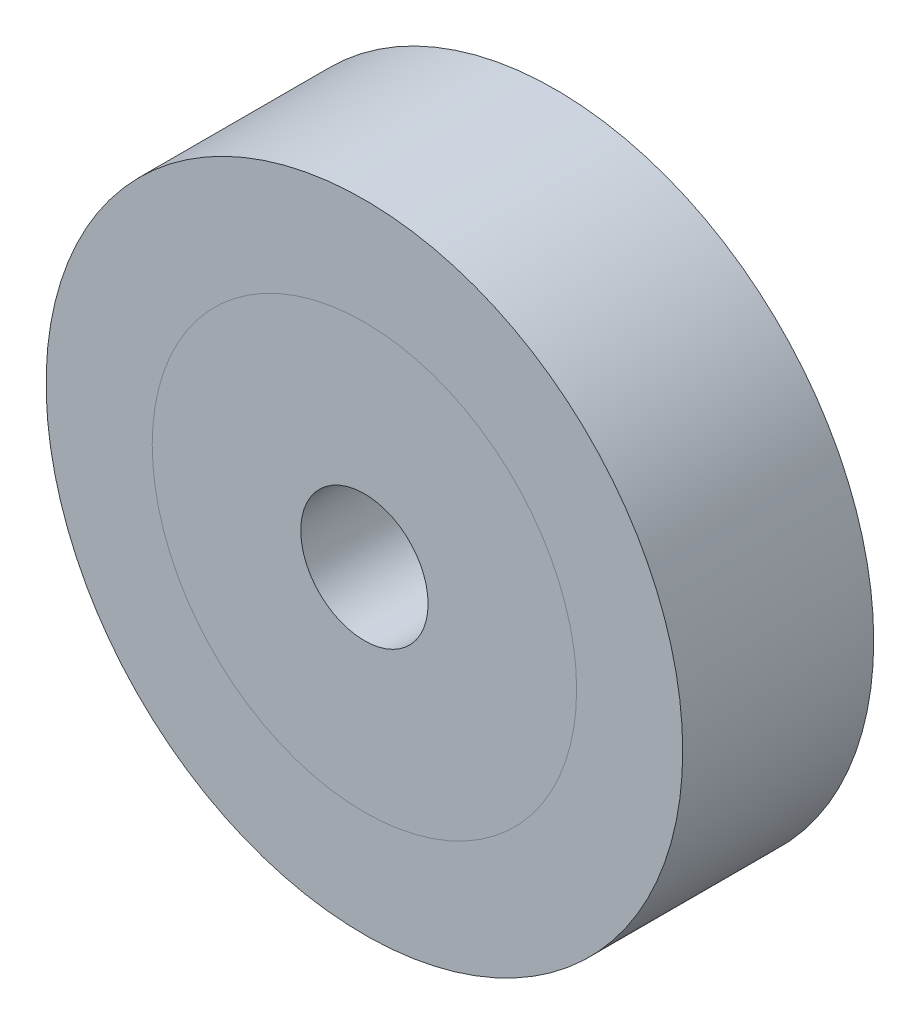
ISO-10303-21;
HEADER;
FILE_DESCRIPTION(('STEP AP214'),'2;1');
FILE_NAME('part.step','',(''),(''),'','','');
FILE_SCHEMA(('AUTOMOTIVE_DESIGN { 1 0 10303 214 1 1 1 1 }'));
ENDSEC;
DATA;
#1=APPLICATION_CONTEXT('core data for automotive mechanical design processes');
#2=APPLICATION_PROTOCOL_DEFINITION('international standard','automotive_design',2000,#1);
#3=PRODUCT_CONTEXT('',#1,'mechanical');
#4=PRODUCT('Part','Part','',(#3));
#5=PRODUCT_RELATED_PRODUCT_CATEGORY('part','',(#4));
#6=PRODUCT_DEFINITION_FORMATION('','',#4);
#7=PRODUCT_DEFINITION_CONTEXT('part definition',#1,'design');
#8=PRODUCT_DEFINITION('design','',#6,#7);
#9=PRODUCT_DEFINITION_SHAPE('','',#8);
#10=(LENGTH_UNIT() NAMED_UNIT(*) SI_UNIT(.MILLI.,.METRE.));
#11=(NAMED_UNIT(*) PLANE_ANGLE_UNIT() SI_UNIT($,.RADIAN.));
#12=(NAMED_UNIT(*) SI_UNIT($,.STERADIAN.) SOLID_ANGLE_UNIT());
#13=UNCERTAINTY_MEASURE_WITH_UNIT(LENGTH_MEASURE(1.E-05),#10,'distance_accuracy_value','');
#14=(GEOMETRIC_REPRESENTATION_CONTEXT(3) GLOBAL_UNCERTAINTY_ASSIGNED_CONTEXT((#13)) GLOBAL_UNIT_ASSIGNED_CONTEXT((#10,
#11,#12)) REPRESENTATION_CONTEXT('',''));
#15=CARTESIAN_POINT('',(0.,0.,0.));
#16=DIRECTION('',(0.,0.,1.));
#17=DIRECTION('',(1.,0.,0.));
#18=AXIS2_PLACEMENT_3D('',#15,#16,#17);
#19=CARTESIAN_POINT('',(0.,0.,-4.5));
#20=DIRECTION('',(0.,0.,1.));
#21=DIRECTION('',(1.,0.,0.));
#22=AXIS2_PLACEMENT_3D('',#19,#20,#21);
#23=PLANE('',#22);
#24=CARTESIAN_POINT('',(0.,0.,-4.5));
#25=DIRECTION('',(0.,0.,1.));
#26=DIRECTION('',(1.,0.,0.));
#27=AXIS2_PLACEMENT_3D('',#24,#25,#26);
#28=CIRCLE('',#27,15.);
#29=CARTESIAN_POINT('',(15.,0.,-4.5));
#30=VERTEX_POINT('',#29);
#31=EDGE_CURVE('E51',#30,#30,#28,.T.);
#32=ORIENTED_EDGE('',*,*,#31,.F.);
#33=EDGE_LOOP('',(#32));
#34=FACE_BOUND('',#33,.T.);
#35=CARTESIAN_POINT('',(0.,0.,-4.5));
#36=DIRECTION('',(0.,0.,1.));
#37=DIRECTION('',(1.,0.,0.));
#38=AXIS2_PLACEMENT_3D('',#35,#36,#37);
#39=CIRCLE('',#38,10.);
#40=CARTESIAN_POINT('',(10.,0.,-4.5));
#41=VERTEX_POINT('',#40);
#42=EDGE_CURVE('E10',#41,#41,#39,.F.);
#43=ORIENTED_EDGE('',*,*,#42,.F.);
#44=EDGE_LOOP('',(#43));
#45=FACE_BOUND('',#44,.T.);
#46=ADVANCED_FACE('F34',(#34,#45),#23,.F.);
#47=CARTESIAN_POINT('',(0.,0.,4.5));
#48=DIRECTION('',(0.,0.,1.));
#49=DIRECTION('',(1.,0.,0.));
#50=AXIS2_PLACEMENT_3D('',#47,#48,#49);
#51=PLANE('',#50);
#52=CARTESIAN_POINT('',(0.,0.,4.5));
#53=DIRECTION('',(0.,0.,1.));
#54=DIRECTION('',(1.,0.,0.));
#55=AXIS2_PLACEMENT_3D('',#52,#53,#54);
#56=CIRCLE('',#55,15.);
#57=CARTESIAN_POINT('',(15.,0.,4.5));
#58=VERTEX_POINT('',#57);
#59=EDGE_CURVE('E49',#58,#58,#56,.T.);
#60=ORIENTED_EDGE('',*,*,#59,.T.);
#61=EDGE_LOOP('',(#60));
#62=FACE_BOUND('',#61,.T.);
#63=CARTESIAN_POINT('',(0.,0.,4.5));
#64=DIRECTION('',(0.,0.,1.));
#65=DIRECTION('',(1.,0.,0.));
#66=AXIS2_PLACEMENT_3D('',#63,#64,#65);
#67=CIRCLE('',#66,10.);
#68=CARTESIAN_POINT('',(10.,0.,4.5));
#69=VERTEX_POINT('',#68);
#70=EDGE_CURVE('E38',#69,#69,#67,.F.);
#71=ORIENTED_EDGE('',*,*,#70,.T.);
#72=EDGE_LOOP('',(#71));
#73=FACE_BOUND('',#72,.T.);
#74=ADVANCED_FACE('F69',(#62,#73),#51,.T.);
#75=ORIENTED_EDGE('',*,*,#70,.F.);
#76=EDGE_LOOP('',(#75));
#77=FACE_BOUND('',#76,.T.);
#78=CARTESIAN_POINT('',(0.,0.,4.5));
#79=DIRECTION('',(0.,0.,1.));
#80=DIRECTION('',(1.,0.,0.));
#81=AXIS2_PLACEMENT_3D('',#78,#79,#80);
#82=CIRCLE('',#81,3.);
#83=CARTESIAN_POINT('',(3.,0.,4.5));
#84=VERTEX_POINT('',#83);
#85=EDGE_CURVE('E54',#84,#84,#82,.T.);
#86=ORIENTED_EDGE('',*,*,#85,.F.);
#87=EDGE_LOOP('',(#86));
#88=FACE_BOUND('',#87,.T.);
#89=ADVANCED_FACE('F66',(#77,#88),#51,.T.);
#90=ORIENTED_EDGE('',*,*,#42,.T.);
#91=EDGE_LOOP('',(#90));
#92=FACE_BOUND('',#91,.T.);
#93=CARTESIAN_POINT('',(0.,0.,-4.5));
#94=DIRECTION('',(0.,0.,1.));
#95=DIRECTION('',(1.,0.,0.));
#96=AXIS2_PLACEMENT_3D('',#93,#94,#95);
#97=CIRCLE('',#96,3.);
#98=CARTESIAN_POINT('',(3.,0.,-4.5));
#99=VERTEX_POINT('',#98);
#100=EDGE_CURVE('E57',#99,#99,#97,.T.);
#101=ORIENTED_EDGE('',*,*,#100,.T.);
#102=EDGE_LOOP('',(#101));
#103=FACE_BOUND('',#102,.T.);
#104=ADVANCED_FACE('F68',(#92,#103),#23,.F.);
#105=CARTESIAN_POINT('',(0.,0.,4.5));
#106=DIRECTION('',(0.,0.,-1.));
#107=DIRECTION('',(-1.,0.,0.));
#108=AXIS2_PLACEMENT_3D('',#105,#106,#107);
#109=CYLINDRICAL_SURFACE('',#108,15.);
#110=ORIENTED_EDGE('',*,*,#59,.F.);
#111=EDGE_LOOP('',(#110));
#112=FACE_BOUND('',#111,.T.);
#113=ORIENTED_EDGE('',*,*,#31,.T.);
#114=EDGE_LOOP('',(#113));
#115=FACE_BOUND('',#114,.T.);
#116=ADVANCED_FACE('F36',(#112,#115),#109,.T.);
#117=CARTESIAN_POINT('',(0.,0.,4.5));
#118=DIRECTION('',(0.,0.,-1.));
#119=DIRECTION('',(-1.,0.,0.));
#120=AXIS2_PLACEMENT_3D('',#117,#118,#119);
#121=CYLINDRICAL_SURFACE('',#120,3.);
#122=ORIENTED_EDGE('',*,*,#85,.T.);
#123=EDGE_LOOP('',(#122));
#124=FACE_BOUND('',#123,.T.);
#125=ORIENTED_EDGE('',*,*,#100,.F.);
#126=EDGE_LOOP('',(#125));
#127=FACE_BOUND('',#126,.T.);
#128=ADVANCED_FACE('F63',(#124,#127),#121,.F.);
#129=CLOSED_SHELL('',(#46,#74,#89,#104,#116,#128));
#130=MANIFOLD_SOLID_BREP('B2',#129);
#131=ADVANCED_BREP_SHAPE_REPRESENTATION('',(#18,#130),#14);
#132=SHAPE_DEFINITION_REPRESENTATION(#9,#131);
ENDSEC;
END-ISO-10303-21;
